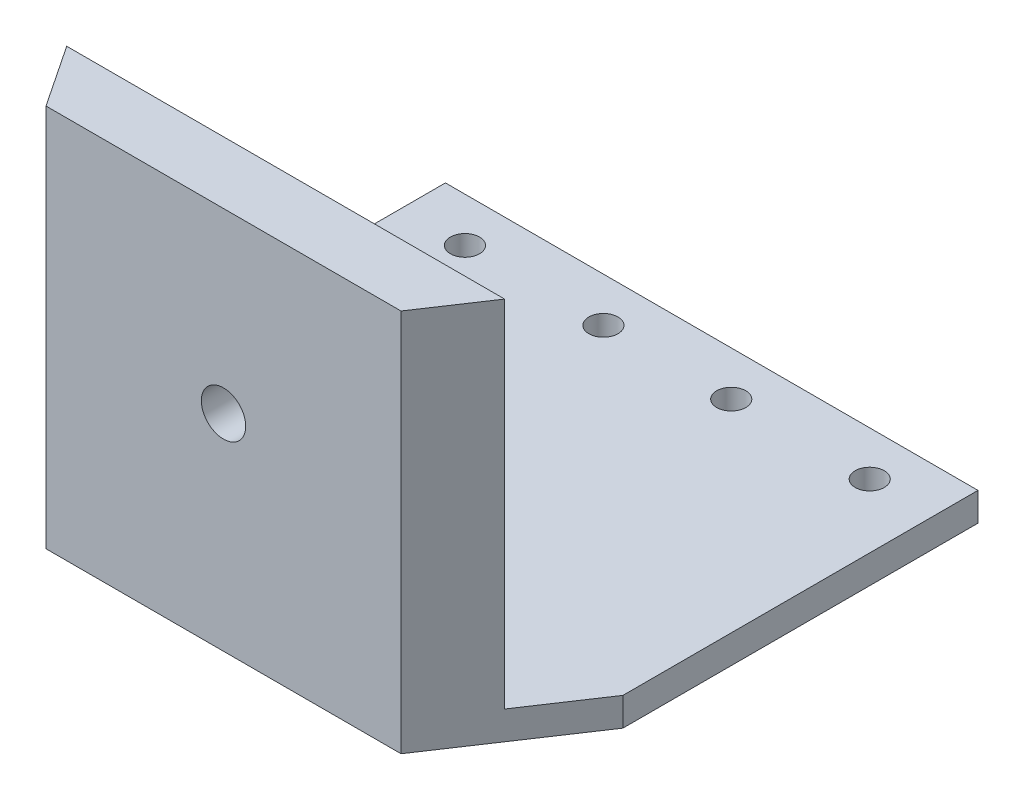
ISO-10303-21;
HEADER;
FILE_DESCRIPTION(('STEP AP214'),'2;1');
FILE_NAME('part.step','',(''),(''),'','','');
FILE_SCHEMA(('AUTOMOTIVE_DESIGN { 1 0 10303 214 1 1 1 1 }'));
ENDSEC;
DATA;
#1=APPLICATION_CONTEXT('core data for automotive mechanical design processes');
#2=APPLICATION_PROTOCOL_DEFINITION('international standard','automotive_design',2000,#1);
#3=PRODUCT_CONTEXT('',#1,'mechanical');
#4=PRODUCT('Part','Part','',(#3));
#5=PRODUCT_RELATED_PRODUCT_CATEGORY('part','',(#4));
#6=PRODUCT_DEFINITION_FORMATION('','',#4);
#7=PRODUCT_DEFINITION_CONTEXT('part definition',#1,'design');
#8=PRODUCT_DEFINITION('design','',#6,#7);
#9=PRODUCT_DEFINITION_SHAPE('','',#8);
#10=(LENGTH_UNIT() NAMED_UNIT(*) SI_UNIT(.MILLI.,.METRE.));
#11=(NAMED_UNIT(*) PLANE_ANGLE_UNIT() SI_UNIT($,.RADIAN.));
#12=(NAMED_UNIT(*) SI_UNIT($,.STERADIAN.) SOLID_ANGLE_UNIT());
#13=UNCERTAINTY_MEASURE_WITH_UNIT(LENGTH_MEASURE(1.E-05),#10,'distance_accuracy_value','');
#14=(GEOMETRIC_REPRESENTATION_CONTEXT(3) GLOBAL_UNCERTAINTY_ASSIGNED_CONTEXT((#13)) GLOBAL_UNIT_ASSIGNED_CONTEXT((#10,
#11,#12)) REPRESENTATION_CONTEXT('',''));
#15=CARTESIAN_POINT('',(0.,0.,0.));
#16=DIRECTION('',(0.,0.,1.));
#17=DIRECTION('',(1.,0.,0.));
#18=AXIS2_PLACEMENT_3D('',#15,#16,#17);
#19=CARTESIAN_POINT('',(0.,2.032,0.));
#20=DIRECTION('',(0.,1.,0.));
#21=DIRECTION('',(0.,0.,1.));
#22=AXIS2_PLACEMENT_3D('',#19,#20,#21);
#23=PLANE('',#22);
#24=CARTESIAN_POINT('',(28.956,2.032,-19.05));
#25=DIRECTION('',(0.,1.,0.));
#26=DIRECTION('',(0.,0.,1.));
#27=AXIS2_PLACEMENT_3D('',#24,#25,#26);
#28=CIRCLE('',#27,2.0828);
#29=CARTESIAN_POINT('',(28.956,2.032,-16.9672));
#30=VERTEX_POINT('',#29);
#31=EDGE_CURVE('E138',#30,#30,#28,.T.);
#32=ORIENTED_EDGE('',*,*,#31,.F.);
#33=EDGE_LOOP('',(#32));
#34=FACE_BOUND('',#33,.T.);
#35=CARTESIAN_POINT('',(9.144,2.032,-19.05));
#36=DIRECTION('',(0.,1.,0.));
#37=DIRECTION('',(0.,0.,1.));
#38=AXIS2_PLACEMENT_3D('',#35,#36,#37);
#39=CIRCLE('',#38,2.0828);
#40=CARTESIAN_POINT('',(9.144,2.032,-16.9672));
#41=VERTEX_POINT('',#40);
#42=EDGE_CURVE('E229',#41,#41,#39,.T.);
#43=ORIENTED_EDGE('',*,*,#42,.F.);
#44=EDGE_LOOP('',(#43));
#45=FACE_BOUND('',#44,.T.);
#46=CARTESIAN_POINT('',(-9.14400000000001,2.032,-19.05));
#47=DIRECTION('',(0.,1.,0.));
#48=DIRECTION('',(0.,0.,1.));
#49=AXIS2_PLACEMENT_3D('',#46,#47,#48);
#50=CIRCLE('',#49,2.0828);
#51=CARTESIAN_POINT('',(-9.14400000000001,2.032,-16.9672));
#52=VERTEX_POINT('',#51);
#53=EDGE_CURVE('E386',#52,#52,#50,.T.);
#54=ORIENTED_EDGE('',*,*,#53,.F.);
#55=EDGE_LOOP('',(#54));
#56=FACE_BOUND('',#55,.T.);
#57=CARTESIAN_POINT('',(-28.956,2.032,-19.05));
#58=DIRECTION('',(0.,1.,0.));
#59=DIRECTION('',(0.,0.,1.));
#60=AXIS2_PLACEMENT_3D('',#57,#58,#59);
#61=CIRCLE('',#60,2.0828);
#62=CARTESIAN_POINT('',(-28.956,2.032,-16.9672));
#63=VERTEX_POINT('',#62);
#64=EDGE_CURVE('E384',#63,#63,#61,.T.);
#65=ORIENTED_EDGE('',*,*,#64,.F.);
#66=EDGE_LOOP('',(#65));
#67=FACE_BOUND('',#66,.T.);
#68=DIRECTION('',(0.554700196225229,0.,0.832050294337844));
#69=VECTOR('',#68,1.);
#70=CARTESIAN_POINT('',(-38.1,2.032,25.4));
#71=LINE('',#70,#69);
#72=CARTESIAN_POINT('',(-38.1,2.032,25.4));
#73=VERTEX_POINT('',#72);
#74=CARTESIAN_POINT('',(-31.3266666666667,2.032,35.56));
#75=VERTEX_POINT('',#74);
#76=EDGE_CURVE('E148',#73,#75,#71,.T.);
#77=ORIENTED_EDGE('',*,*,#76,.T.);
#78=DIRECTION('',(1.,0.,0.));
#79=VECTOR('',#78,1.);
#80=CARTESIAN_POINT('',(0.,2.032,35.56));
#81=LINE('',#80,#79);
#82=CARTESIAN_POINT('',(31.3266666666667,2.032,35.56));
#83=VERTEX_POINT('',#82);
#84=EDGE_CURVE('E110',#75,#83,#81,.T.);
#85=ORIENTED_EDGE('',*,*,#84,.T.);
#86=DIRECTION('',(0.554700196225229,0.,-0.832050294337844));
#87=VECTOR('',#86,1.);
#88=CARTESIAN_POINT('',(38.1,2.032,25.4));
#89=LINE('',#88,#87);
#90=CARTESIAN_POINT('',(38.1,2.032,25.4));
#91=VERTEX_POINT('',#90);
#92=EDGE_CURVE('E142',#83,#91,#89,.T.);
#93=ORIENTED_EDGE('',*,*,#92,.T.);
#94=DIRECTION('',(0.,0.,-1.));
#95=VECTOR('',#94,1.);
#96=CARTESIAN_POINT('',(38.1,2.032,0.));
#97=LINE('',#96,#95);
#98=CARTESIAN_POINT('',(38.1,2.032,-25.4));
#99=VERTEX_POINT('',#98);
#100=EDGE_CURVE('E147',#91,#99,#97,.T.);
#101=ORIENTED_EDGE('',*,*,#100,.T.);
#102=DIRECTION('',(1.,0.,0.));
#103=VECTOR('',#102,1.);
#104=CARTESIAN_POINT('',(0.,2.032,-25.4));
#105=LINE('',#104,#103);
#106=CARTESIAN_POINT('',(-38.1,2.032,-25.4));
#107=VERTEX_POINT('',#106);
#108=EDGE_CURVE('E155',#107,#99,#105,.T.);
#109=ORIENTED_EDGE('',*,*,#108,.F.);
#110=DIRECTION('',(0.,0.,-1.));
#111=VECTOR('',#110,1.);
#112=CARTESIAN_POINT('',(-38.1,2.032,0.));
#113=LINE('',#112,#111);
#114=EDGE_CURVE('E383',#73,#107,#113,.T.);
#115=ORIENTED_EDGE('',*,*,#114,.F.);
#116=EDGE_LOOP('',(#77,#85,#93,#101,#109,#115));
#117=FACE_BOUND('',#116,.T.);
#118=ADVANCED_FACE('F35',(#34,#45,#56,#67,#117),#23,.T.);
#119=CARTESIAN_POINT('',(-38.1,2.032,0.));
#120=DIRECTION('',(-1.,0.,0.));
#121=DIRECTION('',(0.,0.,1.));
#122=AXIS2_PLACEMENT_3D('',#119,#120,#121);
#123=PLANE('',#122);
#124=DIRECTION('',(0.,0.,-1.));
#125=VECTOR('',#124,1.);
#126=CARTESIAN_POINT('',(-38.1,-2.032,0.));
#127=LINE('',#126,#125);
#128=CARTESIAN_POINT('',(-38.1,-2.032,25.4));
#129=VERTEX_POINT('',#128);
#130=CARTESIAN_POINT('',(-38.1,-2.032,-25.4));
#131=VERTEX_POINT('',#130);
#132=EDGE_CURVE('E168',#129,#131,#127,.T.);
#133=ORIENTED_EDGE('',*,*,#132,.F.);
#134=DIRECTION('',(0.,-1.,0.));
#135=VECTOR('',#134,1.);
#136=CARTESIAN_POINT('',(-38.1,2.032,25.4));
#137=LINE('',#136,#135);
#138=EDGE_CURVE('E11',#73,#129,#137,.T.);
#139=ORIENTED_EDGE('',*,*,#138,.F.);
#140=ORIENTED_EDGE('',*,*,#114,.T.);
#141=DIRECTION('',(0.,-1.,0.));
#142=VECTOR('',#141,1.);
#143=CARTESIAN_POINT('',(-38.1,2.032,-25.4));
#144=LINE('',#143,#142);
#145=EDGE_CURVE('E61',#107,#131,#144,.T.);
#146=ORIENTED_EDGE('',*,*,#145,.T.);
#147=EDGE_LOOP('',(#133,#139,#140,#146));
#148=FACE_BOUND('',#147,.T.);
#149=ADVANCED_FACE('F198',(#148),#123,.T.);
#150=CARTESIAN_POINT('',(-38.1,2.032,25.4));
#151=DIRECTION('',(0.832050294337844,0.,-0.554700196225229));
#152=DIRECTION('',(-0.554700196225229,0.,-0.832050294337844));
#153=AXIS2_PLACEMENT_3D('',#150,#151,#152);
#154=PLANE('',#153);
#155=DIRECTION('',(0.554700196225229,0.,0.832050294337844));
#156=VECTOR('',#155,1.);
#157=CARTESIAN_POINT('',(-38.1,-2.032,25.4));
#158=LINE('',#157,#156);
#159=CARTESIAN_POINT('',(-25.4,-2.032,44.45));
#160=VERTEX_POINT('',#159);
#161=EDGE_CURVE('E170',#129,#160,#158,.T.);
#162=ORIENTED_EDGE('',*,*,#161,.T.);
#163=DIRECTION('',(0.,-1.,0.));
#164=VECTOR('',#163,1.);
#165=CARTESIAN_POINT('',(-25.4,2.032,44.45));
#166=LINE('',#165,#164);
#167=CARTESIAN_POINT('',(-25.4,52.832,44.45));
#168=VERTEX_POINT('',#167);
#169=EDGE_CURVE('E44',#168,#160,#166,.T.);
#170=ORIENTED_EDGE('',*,*,#169,.F.);
#171=DIRECTION('',(0.554700196225229,0.,0.832050294337844));
#172=VECTOR('',#171,1.);
#173=CARTESIAN_POINT('',(-38.1,52.832,25.4));
#174=LINE('',#173,#172);
#175=CARTESIAN_POINT('',(-31.3266666666667,52.832,35.56));
#176=VERTEX_POINT('',#175);
#177=EDGE_CURVE('E115',#176,#168,#174,.T.);
#178=ORIENTED_EDGE('',*,*,#177,.F.);
#179=DIRECTION('',(0.,-1.,0.));
#180=VECTOR('',#179,1.);
#181=CARTESIAN_POINT('',(-31.3266666666667,52.832,35.56));
#182=LINE('',#181,#180);
#183=EDGE_CURVE('E105',#176,#75,#182,.T.);
#184=ORIENTED_EDGE('',*,*,#183,.T.);
#185=ORIENTED_EDGE('',*,*,#76,.F.);
#186=ORIENTED_EDGE('',*,*,#138,.T.);
#187=EDGE_LOOP('',(#162,#170,#178,#184,#185,#186));
#188=FACE_BOUND('',#187,.T.);
#189=ADVANCED_FACE('F117',(#188),#154,.F.);
#190=CARTESIAN_POINT('',(0.,2.032,44.45));
#191=DIRECTION('',(0.,0.,-1.));
#192=DIRECTION('',(-1.,0.,0.));
#193=AXIS2_PLACEMENT_3D('',#190,#191,#192);
#194=PLANE('',#193);
#195=CARTESIAN_POINT('',(0.,27.432,44.45));
#196=DIRECTION('',(0.,0.,-1.));
#197=DIRECTION('',(-1.,0.,0.));
#198=AXIS2_PLACEMENT_3D('',#195,#196,#197);
#199=CIRCLE('',#198,3.175);
#200=CARTESIAN_POINT('',(-3.17500000000001,27.432,44.45));
#201=VERTEX_POINT('',#200);
#202=EDGE_CURVE('E128',#201,#201,#199,.T.);
#203=ORIENTED_EDGE('',*,*,#202,.T.);
#204=EDGE_LOOP('',(#203));
#205=FACE_BOUND('',#204,.T.);
#206=DIRECTION('',(1.,0.,0.));
#207=VECTOR('',#206,1.);
#208=CARTESIAN_POINT('',(0.,-2.032,44.45));
#209=LINE('',#208,#207);
#210=CARTESIAN_POINT('',(25.4,-2.032,44.45));
#211=VERTEX_POINT('',#210);
#212=EDGE_CURVE('E172',#160,#211,#209,.T.);
#213=ORIENTED_EDGE('',*,*,#212,.T.);
#214=DIRECTION('',(0.,-1.,0.));
#215=VECTOR('',#214,1.);
#216=CARTESIAN_POINT('',(25.4,2.032,44.45));
#217=LINE('',#216,#215);
#218=CARTESIAN_POINT('',(25.4,52.832,44.45));
#219=VERTEX_POINT('',#218);
#220=EDGE_CURVE('E190',#219,#211,#217,.T.);
#221=ORIENTED_EDGE('',*,*,#220,.F.);
#222=DIRECTION('',(1.,0.,0.));
#223=VECTOR('',#222,1.);
#224=CARTESIAN_POINT('',(0.,52.832,44.45));
#225=LINE('',#224,#223);
#226=EDGE_CURVE('E122',#168,#219,#225,.T.);
#227=ORIENTED_EDGE('',*,*,#226,.F.);
#228=ORIENTED_EDGE('',*,*,#169,.T.);
#229=EDGE_LOOP('',(#213,#221,#227,#228));
#230=FACE_BOUND('',#229,.T.);
#231=ADVANCED_FACE('F194',(#205,#230),#194,.F.);
#232=CARTESIAN_POINT('',(38.1,2.032,25.4));
#233=DIRECTION('',(-0.832050294337844,0.,-0.554700196225229));
#234=DIRECTION('',(-0.554700196225229,0.,0.832050294337844));
#235=AXIS2_PLACEMENT_3D('',#232,#233,#234);
#236=PLANE('',#235);
#237=DIRECTION('',(0.554700196225229,0.,-0.832050294337844));
#238=VECTOR('',#237,1.);
#239=CARTESIAN_POINT('',(38.1,-2.032,25.4));
#240=LINE('',#239,#238);
#241=CARTESIAN_POINT('',(38.1,-2.032,25.4));
#242=VERTEX_POINT('',#241);
#243=EDGE_CURVE('E175',#211,#242,#240,.T.);
#244=ORIENTED_EDGE('',*,*,#243,.T.);
#245=DIRECTION('',(0.,-1.,0.));
#246=VECTOR('',#245,1.);
#247=CARTESIAN_POINT('',(38.1,2.032,25.4));
#248=LINE('',#247,#246);
#249=EDGE_CURVE('E187',#91,#242,#248,.T.);
#250=ORIENTED_EDGE('',*,*,#249,.F.);
#251=ORIENTED_EDGE('',*,*,#92,.F.);
#252=DIRECTION('',(0.,-1.,0.));
#253=VECTOR('',#252,1.);
#254=CARTESIAN_POINT('',(31.3266666666667,52.832,35.56));
#255=LINE('',#254,#253);
#256=CARTESIAN_POINT('',(31.3266666666667,52.832,35.56));
#257=VERTEX_POINT('',#256);
#258=EDGE_CURVE('E52',#257,#83,#255,.T.);
#259=ORIENTED_EDGE('',*,*,#258,.F.);
#260=DIRECTION('',(0.554700196225229,0.,-0.832050294337844));
#261=VECTOR('',#260,1.);
#262=CARTESIAN_POINT('',(38.1,52.832,25.4));
#263=LINE('',#262,#261);
#264=EDGE_CURVE('E126',#219,#257,#263,.T.);
#265=ORIENTED_EDGE('',*,*,#264,.F.);
#266=ORIENTED_EDGE('',*,*,#220,.T.);
#267=EDGE_LOOP('',(#244,#250,#251,#259,#265,#266));
#268=FACE_BOUND('',#267,.T.);
#269=ADVANCED_FACE('F251',(#268),#236,.F.);
#270=CARTESIAN_POINT('',(38.1,2.032,0.));
#271=DIRECTION('',(-1.,0.,0.));
#272=DIRECTION('',(0.,0.,1.));
#273=AXIS2_PLACEMENT_3D('',#270,#271,#272);
#274=PLANE('',#273);
#275=DIRECTION('',(0.,0.,-1.));
#276=VECTOR('',#275,1.);
#277=CARTESIAN_POINT('',(38.1,-2.032,0.));
#278=LINE('',#277,#276);
#279=CARTESIAN_POINT('',(38.1,-2.032,-25.4));
#280=VERTEX_POINT('',#279);
#281=EDGE_CURVE('E178',#242,#280,#278,.T.);
#282=ORIENTED_EDGE('',*,*,#281,.T.);
#283=DIRECTION('',(0.,-1.,0.));
#284=VECTOR('',#283,1.);
#285=CARTESIAN_POINT('',(38.1,2.032,-25.4));
#286=LINE('',#285,#284);
#287=EDGE_CURVE('E185',#99,#280,#286,.T.);
#288=ORIENTED_EDGE('',*,*,#287,.F.);
#289=ORIENTED_EDGE('',*,*,#100,.F.);
#290=ORIENTED_EDGE('',*,*,#249,.T.);
#291=EDGE_LOOP('',(#282,#288,#289,#290));
#292=FACE_BOUND('',#291,.T.);
#293=ADVANCED_FACE('F214',(#292),#274,.F.);
#294=CARTESIAN_POINT('',(-28.956,2.032,-19.05));
#295=DIRECTION('',(0.,-1.,0.));
#296=DIRECTION('',(0.,0.,-1.));
#297=AXIS2_PLACEMENT_3D('',#294,#295,#296);
#298=CYLINDRICAL_SURFACE('',#297,2.0828);
#299=ORIENTED_EDGE('',*,*,#64,.T.);
#300=EDGE_LOOP('',(#299));
#301=FACE_BOUND('',#300,.T.);
#302=CARTESIAN_POINT('',(-28.956,-2.032,-19.05));
#303=DIRECTION('',(0.,1.,0.));
#304=DIRECTION('',(0.,0.,1.));
#305=AXIS2_PLACEMENT_3D('',#302,#303,#304);
#306=CIRCLE('',#305,2.0828);
#307=CARTESIAN_POINT('',(-28.956,-2.032,-16.9672));
#308=VERTEX_POINT('',#307);
#309=EDGE_CURVE('E165',#308,#308,#306,.T.);
#310=ORIENTED_EDGE('',*,*,#309,.F.);
#311=EDGE_LOOP('',(#310));
#312=FACE_BOUND('',#311,.T.);
#313=ADVANCED_FACE('F210',(#301,#312),#298,.F.);
#314=CARTESIAN_POINT('',(-9.14400000000001,2.032,-19.05));
#315=DIRECTION('',(0.,-1.,0.));
#316=DIRECTION('',(0.,0.,-1.));
#317=AXIS2_PLACEMENT_3D('',#314,#315,#316);
#318=CYLINDRICAL_SURFACE('',#317,2.0828);
#319=ORIENTED_EDGE('',*,*,#53,.T.);
#320=EDGE_LOOP('',(#319));
#321=FACE_BOUND('',#320,.T.);
#322=CARTESIAN_POINT('',(-9.14400000000001,-2.032,-19.05));
#323=DIRECTION('',(0.,1.,0.));
#324=DIRECTION('',(0.,0.,1.));
#325=AXIS2_PLACEMENT_3D('',#322,#323,#324);
#326=CIRCLE('',#325,2.0828);
#327=CARTESIAN_POINT('',(-9.14400000000001,-2.032,-16.9672));
#328=VERTEX_POINT('',#327);
#329=EDGE_CURVE('E162',#328,#328,#326,.T.);
#330=ORIENTED_EDGE('',*,*,#329,.F.);
#331=EDGE_LOOP('',(#330));
#332=FACE_BOUND('',#331,.T.);
#333=ADVANCED_FACE('F213',(#321,#332),#318,.F.);
#334=CARTESIAN_POINT('',(9.144,2.032,-19.05));
#335=DIRECTION('',(0.,-1.,0.));
#336=DIRECTION('',(0.,0.,-1.));
#337=AXIS2_PLACEMENT_3D('',#334,#335,#336);
#338=CYLINDRICAL_SURFACE('',#337,2.0828);
#339=ORIENTED_EDGE('',*,*,#42,.T.);
#340=EDGE_LOOP('',(#339));
#341=FACE_BOUND('',#340,.T.);
#342=CARTESIAN_POINT('',(9.144,-2.032,-19.05));
#343=DIRECTION('',(0.,1.,0.));
#344=DIRECTION('',(0.,0.,1.));
#345=AXIS2_PLACEMENT_3D('',#342,#343,#344);
#346=CIRCLE('',#345,2.0828);
#347=CARTESIAN_POINT('',(9.144,-2.032,-16.9672));
#348=VERTEX_POINT('',#347);
#349=EDGE_CURVE('E159',#348,#348,#346,.T.);
#350=ORIENTED_EDGE('',*,*,#349,.F.);
#351=EDGE_LOOP('',(#350));
#352=FACE_BOUND('',#351,.T.);
#353=ADVANCED_FACE('F217',(#341,#352),#338,.F.);
#354=CARTESIAN_POINT('',(28.956,2.032,-19.05));
#355=DIRECTION('',(0.,-1.,0.));
#356=DIRECTION('',(0.,0.,-1.));
#357=AXIS2_PLACEMENT_3D('',#354,#355,#356);
#358=CYLINDRICAL_SURFACE('',#357,2.0828);
#359=ORIENTED_EDGE('',*,*,#31,.T.);
#360=EDGE_LOOP('',(#359));
#361=FACE_BOUND('',#360,.T.);
#362=CARTESIAN_POINT('',(28.956,-2.032,-19.05));
#363=DIRECTION('',(0.,1.,0.));
#364=DIRECTION('',(0.,0.,1.));
#365=AXIS2_PLACEMENT_3D('',#362,#363,#364);
#366=CIRCLE('',#365,2.0828);
#367=CARTESIAN_POINT('',(28.956,-2.032,-16.9672));
#368=VERTEX_POINT('',#367);
#369=EDGE_CURVE('E113',#368,#368,#366,.T.);
#370=ORIENTED_EDGE('',*,*,#369,.F.);
#371=EDGE_LOOP('',(#370));
#372=FACE_BOUND('',#371,.T.);
#373=ADVANCED_FACE('F37',(#361,#372),#358,.F.);
#374=CARTESIAN_POINT('',(0.,2.032,-25.4));
#375=DIRECTION('',(0.,0.,-1.));
#376=DIRECTION('',(-1.,0.,0.));
#377=AXIS2_PLACEMENT_3D('',#374,#375,#376);
#378=PLANE('',#377);
#379=DIRECTION('',(1.,0.,0.));
#380=VECTOR('',#379,1.);
#381=CARTESIAN_POINT('',(0.,-2.032,-25.4));
#382=LINE('',#381,#380);
#383=EDGE_CURVE('E181',#131,#280,#382,.T.);
#384=ORIENTED_EDGE('',*,*,#383,.F.);
#385=ORIENTED_EDGE('',*,*,#145,.F.);
#386=ORIENTED_EDGE('',*,*,#108,.T.);
#387=ORIENTED_EDGE('',*,*,#287,.T.);
#388=EDGE_LOOP('',(#384,#385,#386,#387));
#389=FACE_BOUND('',#388,.T.);
#390=ADVANCED_FACE('F224',(#389),#378,.T.);
#391=CARTESIAN_POINT('',(0.,-2.032,0.));
#392=DIRECTION('',(0.,1.,0.));
#393=DIRECTION('',(0.,0.,1.));
#394=AXIS2_PLACEMENT_3D('',#391,#392,#393);
#395=PLANE('',#394);
#396=ORIENTED_EDGE('',*,*,#369,.T.);
#397=EDGE_LOOP('',(#396));
#398=FACE_BOUND('',#397,.T.);
#399=ORIENTED_EDGE('',*,*,#349,.T.);
#400=EDGE_LOOP('',(#399));
#401=FACE_BOUND('',#400,.T.);
#402=ORIENTED_EDGE('',*,*,#329,.T.);
#403=EDGE_LOOP('',(#402));
#404=FACE_BOUND('',#403,.T.);
#405=ORIENTED_EDGE('',*,*,#309,.T.);
#406=EDGE_LOOP('',(#405));
#407=FACE_BOUND('',#406,.T.);
#408=ORIENTED_EDGE('',*,*,#132,.T.);
#409=ORIENTED_EDGE('',*,*,#383,.T.);
#410=ORIENTED_EDGE('',*,*,#281,.F.);
#411=ORIENTED_EDGE('',*,*,#243,.F.);
#412=ORIENTED_EDGE('',*,*,#212,.F.);
#413=ORIENTED_EDGE('',*,*,#161,.F.);
#414=EDGE_LOOP('',(#408,#409,#410,#411,#412,#413));
#415=FACE_BOUND('',#414,.T.);
#416=ADVANCED_FACE('F197',(#398,#401,#404,#407,#415),#395,.F.);
#417=CARTESIAN_POINT('',(0.,52.832,35.56));
#418=DIRECTION('',(0.,0.,-1.));
#419=DIRECTION('',(-1.,0.,0.));
#420=AXIS2_PLACEMENT_3D('',#417,#418,#419);
#421=PLANE('',#420);
#422=CARTESIAN_POINT('',(0.,27.432,35.56));
#423=DIRECTION('',(0.,0.,-1.));
#424=DIRECTION('',(-1.,0.,0.));
#425=AXIS2_PLACEMENT_3D('',#422,#423,#424);
#426=CIRCLE('',#425,3.175);
#427=CARTESIAN_POINT('',(-3.17500000000001,27.432,35.56));
#428=VERTEX_POINT('',#427);
#429=EDGE_CURVE('E131',#428,#428,#426,.T.);
#430=ORIENTED_EDGE('',*,*,#429,.F.);
#431=EDGE_LOOP('',(#430));
#432=FACE_BOUND('',#431,.T.);
#433=ORIENTED_EDGE('',*,*,#84,.F.);
#434=ORIENTED_EDGE('',*,*,#183,.F.);
#435=DIRECTION('',(1.,0.,0.));
#436=VECTOR('',#435,1.);
#437=CARTESIAN_POINT('',(0.,52.832,35.56));
#438=LINE('',#437,#436);
#439=EDGE_CURVE('E109',#176,#257,#438,.T.);
#440=ORIENTED_EDGE('',*,*,#439,.T.);
#441=ORIENTED_EDGE('',*,*,#258,.T.);
#442=EDGE_LOOP('',(#433,#434,#440,#441));
#443=FACE_BOUND('',#442,.T.);
#444=ADVANCED_FACE('F107',(#432,#443),#421,.T.);
#445=CARTESIAN_POINT('',(0.,52.832,0.));
#446=DIRECTION('',(0.,1.,0.));
#447=DIRECTION('',(0.,0.,1.));
#448=AXIS2_PLACEMENT_3D('',#445,#446,#447);
#449=PLANE('',#448);
#450=ORIENTED_EDGE('',*,*,#439,.F.);
#451=ORIENTED_EDGE('',*,*,#177,.T.);
#452=ORIENTED_EDGE('',*,*,#226,.T.);
#453=ORIENTED_EDGE('',*,*,#264,.T.);
#454=EDGE_LOOP('',(#450,#451,#452,#453));
#455=FACE_BOUND('',#454,.T.);
#456=ADVANCED_FACE('F124',(#455),#449,.T.);
#457=CARTESIAN_POINT('',(0.,27.432,44.45));
#458=DIRECTION('',(0.,0.,-1.));
#459=DIRECTION('',(-1.,0.,0.));
#460=AXIS2_PLACEMENT_3D('',#457,#458,#459);
#461=CYLINDRICAL_SURFACE('',#460,3.175);
#462=ORIENTED_EDGE('',*,*,#202,.F.);
#463=EDGE_LOOP('',(#462));
#464=FACE_BOUND('',#463,.T.);
#465=ORIENTED_EDGE('',*,*,#429,.T.);
#466=EDGE_LOOP('',(#465));
#467=FACE_BOUND('',#466,.T.);
#468=ADVANCED_FACE('F265',(#464,#467),#461,.F.);
#469=CLOSED_SHELL('',(#118,#149,#189,#231,#269,#293,#313,#333,#353,#373,#390,#416,#444,#456,#468));
#470=MANIFOLD_SOLID_BREP('B2',#469);
#471=ADVANCED_BREP_SHAPE_REPRESENTATION('',(#18,#470),#14);
#472=SHAPE_DEFINITION_REPRESENTATION(#9,#471);
ENDSEC;
END-ISO-10303-21;
